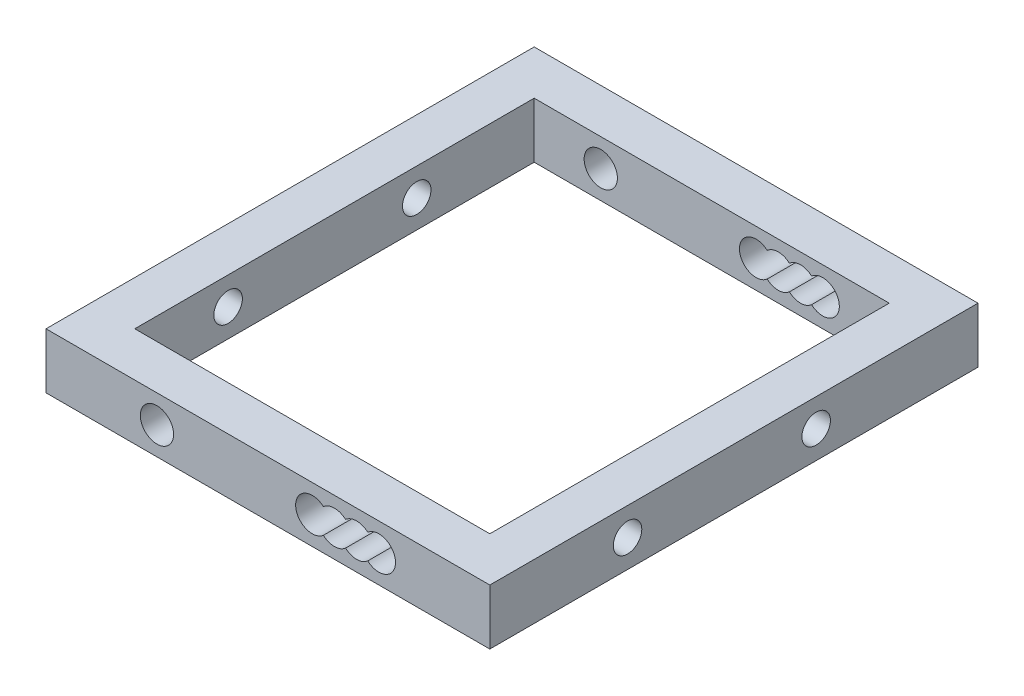
ISO-10303-21;
HEADER;
FILE_DESCRIPTION(('STEP AP214'),'2;1');
FILE_NAME('part.step','',(''),(''),'','','');
FILE_SCHEMA(('AUTOMOTIVE_DESIGN { 1 0 10303 214 1 1 1 1 }'));
ENDSEC;
DATA;
#1=APPLICATION_CONTEXT('core data for automotive mechanical design processes');
#2=APPLICATION_PROTOCOL_DEFINITION('international standard','automotive_design',2000,#1);
#3=PRODUCT_CONTEXT('',#1,'mechanical');
#4=PRODUCT('Part','Part','',(#3));
#5=PRODUCT_RELATED_PRODUCT_CATEGORY('part','',(#4));
#6=PRODUCT_DEFINITION_FORMATION('','',#4);
#7=PRODUCT_DEFINITION_CONTEXT('part definition',#1,'design');
#8=PRODUCT_DEFINITION('design','',#6,#7);
#9=PRODUCT_DEFINITION_SHAPE('','',#8);
#10=(LENGTH_UNIT() NAMED_UNIT(*) SI_UNIT(.MILLI.,.METRE.));
#11=(NAMED_UNIT(*) PLANE_ANGLE_UNIT() SI_UNIT($,.RADIAN.));
#12=(NAMED_UNIT(*) SI_UNIT($,.STERADIAN.) SOLID_ANGLE_UNIT());
#13=UNCERTAINTY_MEASURE_WITH_UNIT(LENGTH_MEASURE(1.E-05),#10,'distance_accuracy_value','');
#14=(GEOMETRIC_REPRESENTATION_CONTEXT(3) GLOBAL_UNCERTAINTY_ASSIGNED_CONTEXT((#13)) GLOBAL_UNIT_ASSIGNED_CONTEXT((#10,
#11,#12)) REPRESENTATION_CONTEXT('',''));
#15=CARTESIAN_POINT('',(0.,0.,0.));
#16=DIRECTION('',(0.,0.,1.));
#17=DIRECTION('',(1.,0.,0.));
#18=AXIS2_PLACEMENT_3D('',#15,#16,#17);
#19=CARTESIAN_POINT('',(16.,-2.5,-40.));
#20=DIRECTION('',(-1.,0.,0.));
#21=DIRECTION('',(0.,0.,1.));
#22=AXIS2_PLACEMENT_3D('',#19,#20,#21);
#23=PLANE('',#22);
#24=CARTESIAN_POINT('',(16.,0.,-25.4129080623112));
#25=DIRECTION('',(-1.,0.,0.));
#26=DIRECTION('',(0.,0.,1.));
#27=AXIS2_PLACEMENT_3D('',#24,#25,#26);
#28=CIRCLE('',#27,1.28530424586943);
#29=CARTESIAN_POINT('',(16.,0.,-24.1276038164417));
#30=VERTEX_POINT('',#29);
#31=EDGE_CURVE('E289',#30,#30,#28,.T.);
#32=ORIENTED_EDGE('',*,*,#31,.F.);
#33=EDGE_LOOP('',(#32));
#34=FACE_BOUND('',#33,.T.);
#35=CARTESIAN_POINT('',(16.,0.,-8.41290806231116));
#36=DIRECTION('',(-1.,0.,0.));
#37=DIRECTION('',(0.,0.,1.));
#38=AXIS2_PLACEMENT_3D('',#35,#36,#37);
#39=CIRCLE('',#38,1.28530424586943);
#40=CARTESIAN_POINT('',(16.,0.,-7.12760381644173));
#41=VERTEX_POINT('',#40);
#42=EDGE_CURVE('E277',#41,#41,#39,.T.);
#43=ORIENTED_EDGE('',*,*,#42,.F.);
#44=EDGE_LOOP('',(#43));
#45=FACE_BOUND('',#44,.T.);
#46=DIRECTION('',(0.,0.,1.));
#47=VECTOR('',#46,1.);
#48=CARTESIAN_POINT('',(16.,2.5,-40.));
#49=LINE('',#48,#47);
#50=CARTESIAN_POINT('',(16.,2.5,-36.));
#51=VERTEX_POINT('',#50);
#52=CARTESIAN_POINT('',(16.,2.5,0.));
#53=VERTEX_POINT('',#52);
#54=EDGE_CURVE('E49',#51,#53,#49,.T.);
#55=ORIENTED_EDGE('',*,*,#54,.F.);
#56=DIRECTION('',(0.,1.,0.));
#57=VECTOR('',#56,1.);
#58=CARTESIAN_POINT('',(16.,-2.5,-36.));
#59=LINE('',#58,#57);
#60=CARTESIAN_POINT('',(16.,-2.5,-36.));
#61=VERTEX_POINT('',#60);
#62=EDGE_CURVE('E54',#61,#51,#59,.T.);
#63=ORIENTED_EDGE('',*,*,#62,.F.);
#64=DIRECTION('',(0.,0.,1.));
#65=VECTOR('',#64,1.);
#66=CARTESIAN_POINT('',(16.,-2.5,-40.));
#67=LINE('',#66,#65);
#68=CARTESIAN_POINT('',(16.,-2.5,0.));
#69=VERTEX_POINT('',#68);
#70=EDGE_CURVE('E178',#61,#69,#67,.T.);
#71=ORIENTED_EDGE('',*,*,#70,.T.);
#72=DIRECTION('',(0.,1.,0.));
#73=VECTOR('',#72,1.);
#74=CARTESIAN_POINT('',(16.,-2.5,0.));
#75=LINE('',#74,#73);
#76=EDGE_CURVE('E317',#69,#53,#75,.T.);
#77=ORIENTED_EDGE('',*,*,#76,.T.);
#78=EDGE_LOOP('',(#55,#63,#71,#77));
#79=FACE_BOUND('',#78,.T.);
#80=ADVANCED_FACE('F32',(#34,#45,#79),#23,.T.);
#81=CARTESIAN_POINT('',(0.,0.,4.));
#82=DIRECTION('',(0.,0.,-1.));
#83=DIRECTION('',(-1.,0.,0.));
#84=AXIS2_PLACEMENT_3D('',#81,#82,#83);
#85=PLANE('',#84);
#86=CARTESIAN_POINT('',(-10.,0.,4.));
#87=DIRECTION('',(0.,0.,1.));
#88=DIRECTION('',(1.,0.,0.));
#89=AXIS2_PLACEMENT_3D('',#86,#87,#88);
#90=CIRCLE('',#89,1.5);
#91=CARTESIAN_POINT('',(-8.49999999999999,0.,4.));
#92=VERTEX_POINT('',#91);
#93=EDGE_CURVE('E326',#92,#92,#90,.T.);
#94=ORIENTED_EDGE('',*,*,#93,.F.);
#95=EDGE_LOOP('',(#94));
#96=FACE_BOUND('',#95,.T.);
#97=DIRECTION('',(1.,0.,0.));
#98=VECTOR('',#97,1.);
#99=CARTESIAN_POINT('',(-16.,-2.5,4.));
#100=LINE('',#99,#98);
#101=CARTESIAN_POINT('',(-20.,-2.5,4.));
#102=VERTEX_POINT('',#101);
#103=CARTESIAN_POINT('',(20.,-2.5,4.));
#104=VERTEX_POINT('',#103);
#105=EDGE_CURVE('E11',#102,#104,#100,.T.);
#106=ORIENTED_EDGE('',*,*,#105,.T.);
#107=DIRECTION('',(0.,1.,0.));
#108=VECTOR('',#107,1.);
#109=CARTESIAN_POINT('',(20.,-2.5,4.));
#110=LINE('',#109,#108);
#111=CARTESIAN_POINT('',(20.,2.5,4.));
#112=VERTEX_POINT('',#111);
#113=EDGE_CURVE('E262',#104,#112,#110,.T.);
#114=ORIENTED_EDGE('',*,*,#113,.T.);
#115=DIRECTION('',(-1.,0.,0.));
#116=VECTOR('',#115,1.);
#117=CARTESIAN_POINT('',(-16.,2.5,4.));
#118=LINE('',#117,#116);
#119=CARTESIAN_POINT('',(-20.,2.5,4.));
#120=VERTEX_POINT('',#119);
#121=EDGE_CURVE('E41',#112,#120,#118,.T.);
#122=ORIENTED_EDGE('',*,*,#121,.T.);
#123=DIRECTION('',(0.,1.,0.));
#124=VECTOR('',#123,1.);
#125=CARTESIAN_POINT('',(-20.,-2.5,4.));
#126=LINE('',#125,#124);
#127=EDGE_CURVE('E191',#102,#120,#126,.T.);
#128=ORIENTED_EDGE('',*,*,#127,.F.);
#129=EDGE_LOOP('',(#106,#114,#122,#128));
#130=FACE_BOUND('',#129,.T.);
#131=CARTESIAN_POINT('',(6.,0.,4.));
#132=DIRECTION('',(0.,0.,1.));
#133=DIRECTION('',(1.,0.,0.));
#134=AXIS2_PLACEMENT_3D('',#131,#132,#133);
#135=CIRCLE('',#134,1.5);
#136=CARTESIAN_POINT('',(5.,-1.1180339887499,4.));
#137=VERTEX_POINT('',#136);
#138=CARTESIAN_POINT('',(7.,-1.1180339887499,4.));
#139=VERTEX_POINT('',#138);
#140=EDGE_CURVE('E352',#137,#139,#135,.T.);
#141=ORIENTED_EDGE('',*,*,#140,.F.);
#142=CARTESIAN_POINT('',(4.,0.,4.));
#143=DIRECTION('',(0.,0.,1.));
#144=DIRECTION('',(1.,0.,0.));
#145=AXIS2_PLACEMENT_3D('',#142,#143,#144);
#146=CIRCLE('',#145,1.5);
#147=CARTESIAN_POINT('',(5.,1.11803398874989,4.));
#148=VERTEX_POINT('',#147);
#149=EDGE_CURVE('E348',#148,#137,#146,.T.);
#150=ORIENTED_EDGE('',*,*,#149,.F.);
#151=CARTESIAN_POINT('',(6.,0.,4.));
#152=DIRECTION('',(0.,0.,1.));
#153=DIRECTION('',(1.,0.,0.));
#154=AXIS2_PLACEMENT_3D('',#151,#152,#153);
#155=CIRCLE('',#154,1.5);
#156=CARTESIAN_POINT('',(7.,1.11803398874989,4.));
#157=VERTEX_POINT('',#156);
#158=EDGE_CURVE('E368',#157,#148,#155,.T.);
#159=ORIENTED_EDGE('',*,*,#158,.F.);
#160=CARTESIAN_POINT('',(8.,0.,4.));
#161=DIRECTION('',(0.,0.,1.));
#162=DIRECTION('',(1.,0.,0.));
#163=AXIS2_PLACEMENT_3D('',#160,#161,#162);
#164=CIRCLE('',#163,1.5);
#165=CARTESIAN_POINT('',(9.,1.11803398874989,4.));
#166=VERTEX_POINT('',#165);
#167=EDGE_CURVE('E371',#166,#157,#164,.T.);
#168=ORIENTED_EDGE('',*,*,#167,.F.);
#169=CARTESIAN_POINT('',(10.,0.,4.));
#170=DIRECTION('',(0.,0.,1.));
#171=DIRECTION('',(1.,0.,0.));
#172=AXIS2_PLACEMENT_3D('',#169,#170,#171);
#173=CIRCLE('',#172,1.5);
#174=CARTESIAN_POINT('',(9.,-1.1180339887499,4.));
#175=VERTEX_POINT('',#174);
#176=EDGE_CURVE('E373',#175,#166,#173,.T.);
#177=ORIENTED_EDGE('',*,*,#176,.F.);
#178=CARTESIAN_POINT('',(8.,0.,4.));
#179=DIRECTION('',(0.,0.,1.));
#180=DIRECTION('',(1.,0.,0.));
#181=AXIS2_PLACEMENT_3D('',#178,#179,#180);
#182=CIRCLE('',#181,1.5);
#183=EDGE_CURVE('E375',#139,#175,#182,.T.);
#184=ORIENTED_EDGE('',*,*,#183,.F.);
#185=EDGE_LOOP('',(#141,#150,#159,#168,#177,#184));
#186=FACE_BOUND('',#185,.T.);
#187=ADVANCED_FACE('F391',(#96,#130,#186),#85,.F.);
#188=CARTESIAN_POINT('',(0.,0.,0.));
#189=DIRECTION('',(0.,0.,-1.));
#190=DIRECTION('',(-1.,0.,0.));
#191=AXIS2_PLACEMENT_3D('',#188,#189,#190);
#192=PLANE('',#191);
#193=CARTESIAN_POINT('',(-10.,0.,0.));
#194=DIRECTION('',(0.,0.,1.));
#195=DIRECTION('',(1.,0.,0.));
#196=AXIS2_PLACEMENT_3D('',#193,#194,#195);
#197=CIRCLE('',#196,1.5);
#198=CARTESIAN_POINT('',(-8.49999999999999,0.,0.));
#199=VERTEX_POINT('',#198);
#200=EDGE_CURVE('E329',#199,#199,#197,.T.);
#201=ORIENTED_EDGE('',*,*,#200,.T.);
#202=EDGE_LOOP('',(#201));
#203=FACE_BOUND('',#202,.T.);
#204=ORIENTED_EDGE('',*,*,#76,.F.);
#205=DIRECTION('',(1.,0.,0.));
#206=VECTOR('',#205,1.);
#207=CARTESIAN_POINT('',(-16.,-2.5,0.));
#208=LINE('',#207,#206);
#209=CARTESIAN_POINT('',(-16.,-2.5,0.));
#210=VERTEX_POINT('',#209);
#211=EDGE_CURVE('E302',#210,#69,#208,.T.);
#212=ORIENTED_EDGE('',*,*,#211,.F.);
#213=DIRECTION('',(0.,-1.,0.));
#214=VECTOR('',#213,1.);
#215=CARTESIAN_POINT('',(-16.,-2.5,0.));
#216=LINE('',#215,#214);
#217=CARTESIAN_POINT('',(-16.,2.5,0.));
#218=VERTEX_POINT('',#217);
#219=EDGE_CURVE('E307',#218,#210,#216,.T.);
#220=ORIENTED_EDGE('',*,*,#219,.F.);
#221=DIRECTION('',(-1.,0.,0.));
#222=VECTOR('',#221,1.);
#223=CARTESIAN_POINT('',(-16.,2.5,0.));
#224=LINE('',#223,#222);
#225=EDGE_CURVE('E313',#53,#218,#224,.T.);
#226=ORIENTED_EDGE('',*,*,#225,.F.);
#227=EDGE_LOOP('',(#204,#212,#220,#226));
#228=FACE_BOUND('',#227,.T.);
#229=CARTESIAN_POINT('',(4.,0.,0.));
#230=DIRECTION('',(0.,0.,1.));
#231=DIRECTION('',(1.,0.,0.));
#232=AXIS2_PLACEMENT_3D('',#229,#230,#231);
#233=CIRCLE('',#232,1.5);
#234=CARTESIAN_POINT('',(5.,1.11803398874989,0.));
#235=VERTEX_POINT('',#234);
#236=CARTESIAN_POINT('',(5.,-1.1180339887499,0.));
#237=VERTEX_POINT('',#236);
#238=EDGE_CURVE('E349',#235,#237,#233,.T.);
#239=ORIENTED_EDGE('',*,*,#238,.T.);
#240=CARTESIAN_POINT('',(6.,0.,0.));
#241=DIRECTION('',(0.,0.,1.));
#242=DIRECTION('',(1.,0.,0.));
#243=AXIS2_PLACEMENT_3D('',#240,#241,#242);
#244=CIRCLE('',#243,1.5);
#245=CARTESIAN_POINT('',(7.,-1.1180339887499,0.));
#246=VERTEX_POINT('',#245);
#247=EDGE_CURVE('E272',#237,#246,#244,.T.);
#248=ORIENTED_EDGE('',*,*,#247,.T.);
#249=CARTESIAN_POINT('',(8.,0.,0.));
#250=DIRECTION('',(0.,0.,1.));
#251=DIRECTION('',(1.,0.,0.));
#252=AXIS2_PLACEMENT_3D('',#249,#250,#251);
#253=CIRCLE('',#252,1.5);
#254=CARTESIAN_POINT('',(9.,-1.1180339887499,0.));
#255=VERTEX_POINT('',#254);
#256=EDGE_CURVE('E362',#246,#255,#253,.T.);
#257=ORIENTED_EDGE('',*,*,#256,.T.);
#258=CARTESIAN_POINT('',(10.,0.,0.));
#259=DIRECTION('',(0.,0.,1.));
#260=DIRECTION('',(1.,0.,0.));
#261=AXIS2_PLACEMENT_3D('',#258,#259,#260);
#262=CIRCLE('',#261,1.5);
#263=CARTESIAN_POINT('',(9.,1.11803398874989,0.));
#264=VERTEX_POINT('',#263);
#265=EDGE_CURVE('E359',#255,#264,#262,.T.);
#266=ORIENTED_EDGE('',*,*,#265,.T.);
#267=CARTESIAN_POINT('',(8.,0.,0.));
#268=DIRECTION('',(0.,0.,1.));
#269=DIRECTION('',(1.,0.,0.));
#270=AXIS2_PLACEMENT_3D('',#267,#268,#269);
#271=CIRCLE('',#270,1.5);
#272=CARTESIAN_POINT('',(7.,1.11803398874989,0.));
#273=VERTEX_POINT('',#272);
#274=EDGE_CURVE('E356',#264,#273,#271,.T.);
#275=ORIENTED_EDGE('',*,*,#274,.T.);
#276=CARTESIAN_POINT('',(6.,0.,0.));
#277=DIRECTION('',(0.,0.,1.));
#278=DIRECTION('',(1.,0.,0.));
#279=AXIS2_PLACEMENT_3D('',#276,#277,#278);
#280=CIRCLE('',#279,1.5);
#281=EDGE_CURVE('E353',#273,#235,#280,.T.);
#282=ORIENTED_EDGE('',*,*,#281,.T.);
#283=EDGE_LOOP('',(#239,#248,#257,#266,#275,#282));
#284=FACE_BOUND('',#283,.T.);
#285=ADVANCED_FACE('F315',(#203,#228,#284),#192,.T.);
#286=CARTESIAN_POINT('',(-16.,2.5,4.));
#287=DIRECTION('',(0.,-1.,0.));
#288=DIRECTION('',(0.,0.,-1.));
#289=AXIS2_PLACEMENT_3D('',#286,#287,#288);
#290=PLANE('',#289);
#291=ORIENTED_EDGE('',*,*,#225,.T.);
#292=DIRECTION('',(0.,0.,1.));
#293=VECTOR('',#292,1.);
#294=CARTESIAN_POINT('',(-16.,2.5,-40.));
#295=LINE('',#294,#293);
#296=CARTESIAN_POINT('',(-16.,2.5,-36.));
#297=VERTEX_POINT('',#296);
#298=EDGE_CURVE('E190',#297,#218,#295,.T.);
#299=ORIENTED_EDGE('',*,*,#298,.F.);
#300=DIRECTION('',(-1.,0.,0.));
#301=VECTOR('',#300,1.);
#302=CARTESIAN_POINT('',(-16.,2.5,-36.));
#303=LINE('',#302,#301);
#304=EDGE_CURVE('E255',#51,#297,#303,.T.);
#305=ORIENTED_EDGE('',*,*,#304,.F.);
#306=ORIENTED_EDGE('',*,*,#54,.T.);
#307=EDGE_LOOP('',(#291,#299,#305,#306));
#308=FACE_BOUND('',#307,.T.);
#309=DIRECTION('',(0.,0.,1.));
#310=VECTOR('',#309,1.);
#311=CARTESIAN_POINT('',(-20.,2.5,-40.));
#312=LINE('',#311,#310);
#313=CARTESIAN_POINT('',(-20.,2.5,-40.));
#314=VERTEX_POINT('',#313);
#315=EDGE_CURVE('E172',#314,#120,#312,.T.);
#316=ORIENTED_EDGE('',*,*,#315,.T.);
#317=ORIENTED_EDGE('',*,*,#121,.F.);
#318=DIRECTION('',(0.,0.,1.));
#319=VECTOR('',#318,1.);
#320=CARTESIAN_POINT('',(20.,2.5,-40.));
#321=LINE('',#320,#319);
#322=CARTESIAN_POINT('',(20.,2.5,-40.));
#323=VERTEX_POINT('',#322);
#324=EDGE_CURVE('E174',#323,#112,#321,.T.);
#325=ORIENTED_EDGE('',*,*,#324,.F.);
#326=DIRECTION('',(-1.,0.,0.));
#327=VECTOR('',#326,1.);
#328=CARTESIAN_POINT('',(16.,2.5,-40.));
#329=LINE('',#328,#327);
#330=EDGE_CURVE('E169',#323,#314,#329,.T.);
#331=ORIENTED_EDGE('',*,*,#330,.T.);
#332=EDGE_LOOP('',(#316,#317,#325,#331));
#333=FACE_BOUND('',#332,.T.);
#334=ADVANCED_FACE('F34',(#308,#333),#290,.F.);
#335=CARTESIAN_POINT('',(-16.,-2.5,4.));
#336=DIRECTION('',(0.,1.,0.));
#337=DIRECTION('',(0.,0.,1.));
#338=AXIS2_PLACEMENT_3D('',#335,#336,#337);
#339=PLANE('',#338);
#340=DIRECTION('',(0.,0.,1.));
#341=VECTOR('',#340,1.);
#342=CARTESIAN_POINT('',(-16.,-2.5,-40.));
#343=LINE('',#342,#341);
#344=CARTESIAN_POINT('',(-16.,-2.5,-36.));
#345=VERTEX_POINT('',#344);
#346=EDGE_CURVE('E198',#345,#210,#343,.T.);
#347=ORIENTED_EDGE('',*,*,#346,.T.);
#348=ORIENTED_EDGE('',*,*,#211,.T.);
#349=ORIENTED_EDGE('',*,*,#70,.F.);
#350=DIRECTION('',(1.,0.,0.));
#351=VECTOR('',#350,1.);
#352=CARTESIAN_POINT('',(-16.,-2.5,-36.));
#353=LINE('',#352,#351);
#354=EDGE_CURVE('E259',#345,#61,#353,.T.);
#355=ORIENTED_EDGE('',*,*,#354,.F.);
#356=EDGE_LOOP('',(#347,#348,#349,#355));
#357=FACE_BOUND('',#356,.T.);
#358=ORIENTED_EDGE('',*,*,#105,.F.);
#359=DIRECTION('',(0.,0.,1.));
#360=VECTOR('',#359,1.);
#361=CARTESIAN_POINT('',(-20.,-2.5,-40.));
#362=LINE('',#361,#360);
#363=CARTESIAN_POINT('',(-20.,-2.5,-40.));
#364=VERTEX_POINT('',#363);
#365=EDGE_CURVE('E196',#364,#102,#362,.T.);
#366=ORIENTED_EDGE('',*,*,#365,.F.);
#367=DIRECTION('',(1.,0.,0.));
#368=VECTOR('',#367,1.);
#369=CARTESIAN_POINT('',(16.,-2.5,-40.));
#370=LINE('',#369,#368);
#371=CARTESIAN_POINT('',(20.,-2.5,-40.));
#372=VERTEX_POINT('',#371);
#373=EDGE_CURVE('E186',#364,#372,#370,.T.);
#374=ORIENTED_EDGE('',*,*,#373,.T.);
#375=DIRECTION('',(0.,0.,1.));
#376=VECTOR('',#375,1.);
#377=CARTESIAN_POINT('',(20.,-2.5,-40.));
#378=LINE('',#377,#376);
#379=EDGE_CURVE('E378',#372,#104,#378,.T.);
#380=ORIENTED_EDGE('',*,*,#379,.T.);
#381=EDGE_LOOP('',(#358,#366,#374,#380));
#382=FACE_BOUND('',#381,.T.);
#383=ADVANCED_FACE('F299',(#357,#382),#339,.F.);
#384=CARTESIAN_POINT('',(-10.,0.,4.));
#385=DIRECTION('',(0.,0.,-1.));
#386=DIRECTION('',(-1.,0.,0.));
#387=AXIS2_PLACEMENT_3D('',#384,#385,#386);
#388=CYLINDRICAL_SURFACE('',#387,1.5);
#389=ORIENTED_EDGE('',*,*,#93,.T.);
#390=EDGE_LOOP('',(#389));
#391=FACE_BOUND('',#390,.T.);
#392=ORIENTED_EDGE('',*,*,#200,.F.);
#393=EDGE_LOOP('',(#392));
#394=FACE_BOUND('',#393,.T.);
#395=ADVANCED_FACE('F390',(#391,#394),#388,.F.);
#396=CARTESIAN_POINT('',(6.,0.,4.));
#397=DIRECTION('',(0.,0.,-1.));
#398=DIRECTION('',(-1.,0.,0.));
#399=AXIS2_PLACEMENT_3D('',#396,#397,#398);
#400=CYLINDRICAL_SURFACE('',#399,1.5);
#401=ORIENTED_EDGE('',*,*,#247,.F.);
#402=DIRECTION('',(0.,0.,-1.));
#403=VECTOR('',#402,1.);
#404=CARTESIAN_POINT('',(5.,-1.1180339887499,4.));
#405=LINE('',#404,#403);
#406=EDGE_CURVE('E345',#137,#237,#405,.T.);
#407=ORIENTED_EDGE('',*,*,#406,.F.);
#408=ORIENTED_EDGE('',*,*,#140,.T.);
#409=DIRECTION('',(0.,0.,-1.));
#410=VECTOR('',#409,1.);
#411=CARTESIAN_POINT('',(7.,-1.1180339887499,4.));
#412=LINE('',#411,#410);
#413=EDGE_CURVE('E332',#139,#246,#412,.T.);
#414=ORIENTED_EDGE('',*,*,#413,.T.);
#415=EDGE_LOOP('',(#401,#407,#408,#414));
#416=FACE_BOUND('',#415,.T.);
#417=ADVANCED_FACE('F427',(#416),#400,.F.);
#418=CARTESIAN_POINT('',(8.,0.,4.));
#419=DIRECTION('',(0.,0.,-1.));
#420=DIRECTION('',(-1.,0.,0.));
#421=AXIS2_PLACEMENT_3D('',#418,#419,#420);
#422=CYLINDRICAL_SURFACE('',#421,1.5);
#423=ORIENTED_EDGE('',*,*,#256,.F.);
#424=ORIENTED_EDGE('',*,*,#413,.F.);
#425=ORIENTED_EDGE('',*,*,#183,.T.);
#426=DIRECTION('',(0.,0.,-1.));
#427=VECTOR('',#426,1.);
#428=CARTESIAN_POINT('',(9.,-1.1180339887499,4.));
#429=LINE('',#428,#427);
#430=EDGE_CURVE('E337',#175,#255,#429,.T.);
#431=ORIENTED_EDGE('',*,*,#430,.T.);
#432=EDGE_LOOP('',(#423,#424,#425,#431));
#433=FACE_BOUND('',#432,.T.);
#434=ADVANCED_FACE('F423',(#433),#422,.F.);
#435=CARTESIAN_POINT('',(10.,0.,4.));
#436=DIRECTION('',(0.,0.,-1.));
#437=DIRECTION('',(-1.,0.,0.));
#438=AXIS2_PLACEMENT_3D('',#435,#436,#437);
#439=CYLINDRICAL_SURFACE('',#438,1.5);
#440=ORIENTED_EDGE('',*,*,#265,.F.);
#441=ORIENTED_EDGE('',*,*,#430,.F.);
#442=ORIENTED_EDGE('',*,*,#176,.T.);
#443=DIRECTION('',(0.,0.,-1.));
#444=VECTOR('',#443,1.);
#445=CARTESIAN_POINT('',(9.,1.11803398874989,4.));
#446=LINE('',#445,#444);
#447=EDGE_CURVE('E339',#166,#264,#446,.T.);
#448=ORIENTED_EDGE('',*,*,#447,.T.);
#449=EDGE_LOOP('',(#440,#441,#442,#448));
#450=FACE_BOUND('',#449,.T.);
#451=ADVANCED_FACE('F419',(#450),#439,.F.);
#452=CARTESIAN_POINT('',(8.,0.,4.));
#453=DIRECTION('',(0.,0.,-1.));
#454=DIRECTION('',(-1.,0.,0.));
#455=AXIS2_PLACEMENT_3D('',#452,#453,#454);
#456=CYLINDRICAL_SURFACE('',#455,1.5);
#457=ORIENTED_EDGE('',*,*,#274,.F.);
#458=ORIENTED_EDGE('',*,*,#447,.F.);
#459=ORIENTED_EDGE('',*,*,#167,.T.);
#460=DIRECTION('',(0.,0.,-1.));
#461=VECTOR('',#460,1.);
#462=CARTESIAN_POINT('',(7.,1.11803398874989,4.));
#463=LINE('',#462,#461);
#464=EDGE_CURVE('E341',#157,#273,#463,.T.);
#465=ORIENTED_EDGE('',*,*,#464,.T.);
#466=EDGE_LOOP('',(#457,#458,#459,#465));
#467=FACE_BOUND('',#466,.T.);
#468=ADVANCED_FACE('F415',(#467),#456,.F.);
#469=CARTESIAN_POINT('',(6.,0.,4.));
#470=DIRECTION('',(0.,0.,-1.));
#471=DIRECTION('',(-1.,0.,0.));
#472=AXIS2_PLACEMENT_3D('',#469,#470,#471);
#473=CYLINDRICAL_SURFACE('',#472,1.5);
#474=ORIENTED_EDGE('',*,*,#281,.F.);
#475=ORIENTED_EDGE('',*,*,#464,.F.);
#476=ORIENTED_EDGE('',*,*,#158,.T.);
#477=DIRECTION('',(0.,0.,-1.));
#478=VECTOR('',#477,1.);
#479=CARTESIAN_POINT('',(5.,1.11803398874989,4.));
#480=LINE('',#479,#478);
#481=EDGE_CURVE('E343',#148,#235,#480,.T.);
#482=ORIENTED_EDGE('',*,*,#481,.T.);
#483=EDGE_LOOP('',(#474,#475,#476,#482));
#484=FACE_BOUND('',#483,.T.);
#485=ADVANCED_FACE('F411',(#484),#473,.F.);
#486=CARTESIAN_POINT('',(4.,0.,4.));
#487=DIRECTION('',(0.,0.,-1.));
#488=DIRECTION('',(-1.,0.,0.));
#489=AXIS2_PLACEMENT_3D('',#486,#487,#488);
#490=CYLINDRICAL_SURFACE('',#489,1.5);
#491=ORIENTED_EDGE('',*,*,#238,.F.);
#492=ORIENTED_EDGE('',*,*,#481,.F.);
#493=ORIENTED_EDGE('',*,*,#149,.T.);
#494=ORIENTED_EDGE('',*,*,#406,.T.);
#495=EDGE_LOOP('',(#491,#492,#493,#494));
#496=FACE_BOUND('',#495,.T.);
#497=ADVANCED_FACE('F408',(#496),#490,.F.);
#498=CARTESIAN_POINT('',(20.,-2.5,-40.));
#499=DIRECTION('',(1.,0.,0.));
#500=DIRECTION('',(0.,0.,-1.));
#501=AXIS2_PLACEMENT_3D('',#498,#499,#500);
#502=PLANE('',#501);
#503=CARTESIAN_POINT('',(20.,0.,-25.4129080623112));
#504=DIRECTION('',(1.,0.,0.));
#505=DIRECTION('',(0.,0.,-1.));
#506=AXIS2_PLACEMENT_3D('',#503,#504,#505);
#507=CIRCLE('',#506,1.28530424586943);
#508=CARTESIAN_POINT('',(20.,0.,-26.6982123081806));
#509=VERTEX_POINT('',#508);
#510=EDGE_CURVE('E465',#509,#509,#507,.T.);
#511=ORIENTED_EDGE('',*,*,#510,.F.);
#512=EDGE_LOOP('',(#511));
#513=FACE_BOUND('',#512,.T.);
#514=CARTESIAN_POINT('',(20.,0.,-8.41290806231116));
#515=DIRECTION('',(1.,0.,0.));
#516=DIRECTION('',(0.,0.,-1.));
#517=AXIS2_PLACEMENT_3D('',#514,#515,#516);
#518=CIRCLE('',#517,1.28530424586943);
#519=CARTESIAN_POINT('',(20.,0.,-9.69821230818059));
#520=VERTEX_POINT('',#519);
#521=EDGE_CURVE('E284',#520,#520,#518,.T.);
#522=ORIENTED_EDGE('',*,*,#521,.F.);
#523=EDGE_LOOP('',(#522));
#524=FACE_BOUND('',#523,.T.);
#525=ORIENTED_EDGE('',*,*,#113,.F.);
#526=ORIENTED_EDGE('',*,*,#379,.F.);
#527=DIRECTION('',(0.,1.,0.));
#528=VECTOR('',#527,1.);
#529=CARTESIAN_POINT('',(20.,-2.5,-40.));
#530=LINE('',#529,#528);
#531=EDGE_CURVE('E179',#372,#323,#530,.T.);
#532=ORIENTED_EDGE('',*,*,#531,.T.);
#533=ORIENTED_EDGE('',*,*,#324,.T.);
#534=EDGE_LOOP('',(#525,#526,#532,#533));
#535=FACE_BOUND('',#534,.T.);
#536=ADVANCED_FACE('F406',(#513,#524,#535),#502,.T.);
#537=CARTESIAN_POINT('',(0.,0.,-40.));
#538=DIRECTION('',(0.,0.,-1.));
#539=DIRECTION('',(-1.,0.,0.));
#540=AXIS2_PLACEMENT_3D('',#537,#538,#539);
#541=PLANE('',#540);
#542=ORIENTED_EDGE('',*,*,#373,.F.);
#543=DIRECTION('',(0.,1.,0.));
#544=VECTOR('',#543,1.);
#545=CARTESIAN_POINT('',(-20.,-2.5,-40.));
#546=LINE('',#545,#544);
#547=EDGE_CURVE('E182',#364,#314,#546,.T.);
#548=ORIENTED_EDGE('',*,*,#547,.T.);
#549=ORIENTED_EDGE('',*,*,#330,.F.);
#550=ORIENTED_EDGE('',*,*,#531,.F.);
#551=EDGE_LOOP('',(#542,#548,#549,#550));
#552=FACE_BOUND('',#551,.T.);
#553=CARTESIAN_POINT('',(-10.,0.,-40.));
#554=DIRECTION('',(0.,0.,1.));
#555=DIRECTION('',(1.,0.,0.));
#556=AXIS2_PLACEMENT_3D('',#553,#554,#555);
#557=CIRCLE('',#556,1.5);
#558=CARTESIAN_POINT('',(-8.49999999999999,0.,-40.));
#559=VERTEX_POINT('',#558);
#560=EDGE_CURVE('E248',#559,#559,#557,.T.);
#561=ORIENTED_EDGE('',*,*,#560,.T.);
#562=EDGE_LOOP('',(#561));
#563=FACE_BOUND('',#562,.T.);
#564=CARTESIAN_POINT('',(4.,0.,-40.));
#565=DIRECTION('',(0.,0.,1.));
#566=DIRECTION('',(1.,0.,0.));
#567=AXIS2_PLACEMENT_3D('',#564,#565,#566);
#568=CIRCLE('',#567,1.5);
#569=CARTESIAN_POINT('',(5.,1.11803398874989,-40.));
#570=VERTEX_POINT('',#569);
#571=CARTESIAN_POINT('',(5.,-1.1180339887499,-40.));
#572=VERTEX_POINT('',#571);
#573=EDGE_CURVE('E206',#570,#572,#568,.T.);
#574=ORIENTED_EDGE('',*,*,#573,.T.);
#575=CARTESIAN_POINT('',(6.,0.,-40.));
#576=DIRECTION('',(0.,0.,1.));
#577=DIRECTION('',(1.,0.,0.));
#578=AXIS2_PLACEMENT_3D('',#575,#576,#577);
#579=CIRCLE('',#578,1.5);
#580=CARTESIAN_POINT('',(7.,-1.1180339887499,-40.));
#581=VERTEX_POINT('',#580);
#582=EDGE_CURVE('E218',#572,#581,#579,.T.);
#583=ORIENTED_EDGE('',*,*,#582,.T.);
#584=CARTESIAN_POINT('',(8.,0.,-40.));
#585=DIRECTION('',(0.,0.,1.));
#586=DIRECTION('',(1.,0.,0.));
#587=AXIS2_PLACEMENT_3D('',#584,#585,#586);
#588=CIRCLE('',#587,1.5);
#589=CARTESIAN_POINT('',(9.,-1.1180339887499,-40.));
#590=VERTEX_POINT('',#589);
#591=EDGE_CURVE('E221',#581,#590,#588,.T.);
#592=ORIENTED_EDGE('',*,*,#591,.T.);
#593=CARTESIAN_POINT('',(10.,0.,-40.));
#594=DIRECTION('',(0.,0.,1.));
#595=DIRECTION('',(1.,0.,0.));
#596=AXIS2_PLACEMENT_3D('',#593,#594,#595);
#597=CIRCLE('',#596,1.5);
#598=CARTESIAN_POINT('',(9.,1.11803398874989,-40.));
#599=VERTEX_POINT('',#598);
#600=EDGE_CURVE('E224',#590,#599,#597,.T.);
#601=ORIENTED_EDGE('',*,*,#600,.T.);
#602=CARTESIAN_POINT('',(8.,0.,-40.));
#603=DIRECTION('',(0.,0.,1.));
#604=DIRECTION('',(1.,0.,0.));
#605=AXIS2_PLACEMENT_3D('',#602,#603,#604);
#606=CIRCLE('',#605,1.5);
#607=CARTESIAN_POINT('',(7.,1.11803398874989,-40.));
#608=VERTEX_POINT('',#607);
#609=EDGE_CURVE('E227',#599,#608,#606,.T.);
#610=ORIENTED_EDGE('',*,*,#609,.T.);
#611=CARTESIAN_POINT('',(6.,0.,-40.));
#612=DIRECTION('',(0.,0.,1.));
#613=DIRECTION('',(1.,0.,0.));
#614=AXIS2_PLACEMENT_3D('',#611,#612,#613);
#615=CIRCLE('',#614,1.5);
#616=EDGE_CURVE('E230',#608,#570,#615,.T.);
#617=ORIENTED_EDGE('',*,*,#616,.T.);
#618=EDGE_LOOP('',(#574,#583,#592,#601,#610,#617));
#619=FACE_BOUND('',#618,.T.);
#620=ADVANCED_FACE('F183',(#552,#563,#619),#541,.T.);
#621=CARTESIAN_POINT('',(0.,0.,-36.));
#622=DIRECTION('',(0.,0.,-1.));
#623=DIRECTION('',(-1.,0.,0.));
#624=AXIS2_PLACEMENT_3D('',#621,#622,#623);
#625=PLANE('',#624);
#626=CARTESIAN_POINT('',(-10.,0.,-36.));
#627=DIRECTION('',(0.,0.,1.));
#628=DIRECTION('',(1.,0.,0.));
#629=AXIS2_PLACEMENT_3D('',#626,#627,#628);
#630=CIRCLE('',#629,1.5);
#631=CARTESIAN_POINT('',(-8.49999999999999,0.,-36.));
#632=VERTEX_POINT('',#631);
#633=EDGE_CURVE('E249',#632,#632,#630,.T.);
#634=ORIENTED_EDGE('',*,*,#633,.F.);
#635=EDGE_LOOP('',(#634));
#636=FACE_BOUND('',#635,.T.);
#637=ORIENTED_EDGE('',*,*,#62,.T.);
#638=ORIENTED_EDGE('',*,*,#304,.T.);
#639=DIRECTION('',(0.,-1.,0.));
#640=VECTOR('',#639,1.);
#641=CARTESIAN_POINT('',(-16.,-2.5,-36.));
#642=LINE('',#641,#640);
#643=EDGE_CURVE('E257',#297,#345,#642,.T.);
#644=ORIENTED_EDGE('',*,*,#643,.T.);
#645=ORIENTED_EDGE('',*,*,#354,.T.);
#646=EDGE_LOOP('',(#637,#638,#644,#645));
#647=FACE_BOUND('',#646,.T.);
#648=CARTESIAN_POINT('',(6.,0.,-36.));
#649=DIRECTION('',(0.,0.,1.));
#650=DIRECTION('',(1.,0.,0.));
#651=AXIS2_PLACEMENT_3D('',#648,#649,#650);
#652=CIRCLE('',#651,1.5);
#653=CARTESIAN_POINT('',(5.,-1.1180339887499,-36.));
#654=VERTEX_POINT('',#653);
#655=CARTESIAN_POINT('',(7.,-1.1180339887499,-36.));
#656=VERTEX_POINT('',#655);
#657=EDGE_CURVE('E203',#654,#656,#652,.T.);
#658=ORIENTED_EDGE('',*,*,#657,.F.);
#659=CARTESIAN_POINT('',(4.,0.,-36.));
#660=DIRECTION('',(0.,0.,1.));
#661=DIRECTION('',(1.,0.,0.));
#662=AXIS2_PLACEMENT_3D('',#659,#660,#661);
#663=CIRCLE('',#662,1.5);
#664=CARTESIAN_POINT('',(5.,1.11803398874989,-36.));
#665=VERTEX_POINT('',#664);
#666=EDGE_CURVE('E215',#665,#654,#663,.T.);
#667=ORIENTED_EDGE('',*,*,#666,.F.);
#668=CARTESIAN_POINT('',(6.,0.,-36.));
#669=DIRECTION('',(0.,0.,1.));
#670=DIRECTION('',(1.,0.,0.));
#671=AXIS2_PLACEMENT_3D('',#668,#669,#670);
#672=CIRCLE('',#671,1.5);
#673=CARTESIAN_POINT('',(7.,1.11803398874989,-36.));
#674=VERTEX_POINT('',#673);
#675=EDGE_CURVE('E212',#674,#665,#672,.T.);
#676=ORIENTED_EDGE('',*,*,#675,.F.);
#677=CARTESIAN_POINT('',(8.,0.,-36.));
#678=DIRECTION('',(0.,0.,1.));
#679=DIRECTION('',(1.,0.,0.));
#680=AXIS2_PLACEMENT_3D('',#677,#678,#679);
#681=CIRCLE('',#680,1.5);
#682=CARTESIAN_POINT('',(9.,1.11803398874989,-36.));
#683=VERTEX_POINT('',#682);
#684=EDGE_CURVE('E210',#683,#674,#681,.T.);
#685=ORIENTED_EDGE('',*,*,#684,.F.);
#686=CARTESIAN_POINT('',(10.,0.,-36.));
#687=DIRECTION('',(0.,0.,1.));
#688=DIRECTION('',(1.,0.,0.));
#689=AXIS2_PLACEMENT_3D('',#686,#687,#688);
#690=CIRCLE('',#689,1.5);
#691=CARTESIAN_POINT('',(9.,-1.1180339887499,-36.));
#692=VERTEX_POINT('',#691);
#693=EDGE_CURVE('E208',#692,#683,#690,.T.);
#694=ORIENTED_EDGE('',*,*,#693,.F.);
#695=CARTESIAN_POINT('',(8.,0.,-36.));
#696=DIRECTION('',(0.,0.,1.));
#697=DIRECTION('',(1.,0.,0.));
#698=AXIS2_PLACEMENT_3D('',#695,#696,#697);
#699=CIRCLE('',#698,1.5);
#700=EDGE_CURVE('E205',#656,#692,#699,.T.);
#701=ORIENTED_EDGE('',*,*,#700,.F.);
#702=EDGE_LOOP('',(#658,#667,#676,#685,#694,#701));
#703=FACE_BOUND('',#702,.T.);
#704=ADVANCED_FACE('F382',(#636,#647,#703),#625,.F.);
#705=CARTESIAN_POINT('',(-10.,0.,-36.));
#706=DIRECTION('',(0.,0.,-1.));
#707=DIRECTION('',(-1.,0.,0.));
#708=AXIS2_PLACEMENT_3D('',#705,#706,#707);
#709=CYLINDRICAL_SURFACE('',#708,1.5);
#710=ORIENTED_EDGE('',*,*,#633,.T.);
#711=EDGE_LOOP('',(#710));
#712=FACE_BOUND('',#711,.T.);
#713=ORIENTED_EDGE('',*,*,#560,.F.);
#714=EDGE_LOOP('',(#713));
#715=FACE_BOUND('',#714,.T.);
#716=ADVANCED_FACE('F514',(#712,#715),#709,.F.);
#717=CARTESIAN_POINT('',(6.,0.,-36.));
#718=DIRECTION('',(0.,0.,-1.));
#719=DIRECTION('',(-1.,0.,0.));
#720=AXIS2_PLACEMENT_3D('',#717,#718,#719);
#721=CYLINDRICAL_SURFACE('',#720,1.5);
#722=ORIENTED_EDGE('',*,*,#582,.F.);
#723=DIRECTION('',(0.,0.,-1.));
#724=VECTOR('',#723,1.);
#725=CARTESIAN_POINT('',(5.,-1.1180339887499,-36.));
#726=LINE('',#725,#724);
#727=EDGE_CURVE('E217',#654,#572,#726,.T.);
#728=ORIENTED_EDGE('',*,*,#727,.F.);
#729=ORIENTED_EDGE('',*,*,#657,.T.);
#730=DIRECTION('',(0.,0.,-1.));
#731=VECTOR('',#730,1.);
#732=CARTESIAN_POINT('',(7.,-1.1180339887499,-36.));
#733=LINE('',#732,#731);
#734=EDGE_CURVE('E245',#656,#581,#733,.T.);
#735=ORIENTED_EDGE('',*,*,#734,.T.);
#736=EDGE_LOOP('',(#722,#728,#729,#735));
#737=FACE_BOUND('',#736,.T.);
#738=ADVANCED_FACE('F510',(#737),#721,.F.);
#739=CARTESIAN_POINT('',(8.,0.,-36.));
#740=DIRECTION('',(0.,0.,-1.));
#741=DIRECTION('',(-1.,0.,0.));
#742=AXIS2_PLACEMENT_3D('',#739,#740,#741);
#743=CYLINDRICAL_SURFACE('',#742,1.5);
#744=ORIENTED_EDGE('',*,*,#591,.F.);
#745=ORIENTED_EDGE('',*,*,#734,.F.);
#746=ORIENTED_EDGE('',*,*,#700,.T.);
#747=DIRECTION('',(0.,0.,-1.));
#748=VECTOR('',#747,1.);
#749=CARTESIAN_POINT('',(9.,-1.1180339887499,-36.));
#750=LINE('',#749,#748);
#751=EDGE_CURVE('E243',#692,#590,#750,.T.);
#752=ORIENTED_EDGE('',*,*,#751,.T.);
#753=EDGE_LOOP('',(#744,#745,#746,#752));
#754=FACE_BOUND('',#753,.T.);
#755=ADVANCED_FACE('F506',(#754),#743,.F.);
#756=CARTESIAN_POINT('',(10.,0.,-36.));
#757=DIRECTION('',(0.,0.,-1.));
#758=DIRECTION('',(-1.,0.,0.));
#759=AXIS2_PLACEMENT_3D('',#756,#757,#758);
#760=CYLINDRICAL_SURFACE('',#759,1.5);
#761=ORIENTED_EDGE('',*,*,#600,.F.);
#762=ORIENTED_EDGE('',*,*,#751,.F.);
#763=ORIENTED_EDGE('',*,*,#693,.T.);
#764=DIRECTION('',(0.,0.,-1.));
#765=VECTOR('',#764,1.);
#766=CARTESIAN_POINT('',(9.,1.11803398874989,-36.));
#767=LINE('',#766,#765);
#768=EDGE_CURVE('E241',#683,#599,#767,.T.);
#769=ORIENTED_EDGE('',*,*,#768,.T.);
#770=EDGE_LOOP('',(#761,#762,#763,#769));
#771=FACE_BOUND('',#770,.T.);
#772=ADVANCED_FACE('F502',(#771),#760,.F.);
#773=CARTESIAN_POINT('',(8.,0.,-36.));
#774=DIRECTION('',(0.,0.,-1.));
#775=DIRECTION('',(-1.,0.,0.));
#776=AXIS2_PLACEMENT_3D('',#773,#774,#775);
#777=CYLINDRICAL_SURFACE('',#776,1.5);
#778=ORIENTED_EDGE('',*,*,#609,.F.);
#779=ORIENTED_EDGE('',*,*,#768,.F.);
#780=ORIENTED_EDGE('',*,*,#684,.T.);
#781=DIRECTION('',(0.,0.,-1.));
#782=VECTOR('',#781,1.);
#783=CARTESIAN_POINT('',(7.,1.11803398874989,-36.));
#784=LINE('',#783,#782);
#785=EDGE_CURVE('E239',#674,#608,#784,.T.);
#786=ORIENTED_EDGE('',*,*,#785,.T.);
#787=EDGE_LOOP('',(#778,#779,#780,#786));
#788=FACE_BOUND('',#787,.T.);
#789=ADVANCED_FACE('F498',(#788),#777,.F.);
#790=CARTESIAN_POINT('',(6.,0.,-36.));
#791=DIRECTION('',(0.,0.,-1.));
#792=DIRECTION('',(-1.,0.,0.));
#793=AXIS2_PLACEMENT_3D('',#790,#791,#792);
#794=CYLINDRICAL_SURFACE('',#793,1.5);
#795=ORIENTED_EDGE('',*,*,#616,.F.);
#796=ORIENTED_EDGE('',*,*,#785,.F.);
#797=ORIENTED_EDGE('',*,*,#675,.T.);
#798=DIRECTION('',(0.,0.,-1.));
#799=VECTOR('',#798,1.);
#800=CARTESIAN_POINT('',(5.,1.11803398874989,-36.));
#801=LINE('',#800,#799);
#802=EDGE_CURVE('E237',#665,#570,#801,.T.);
#803=ORIENTED_EDGE('',*,*,#802,.T.);
#804=EDGE_LOOP('',(#795,#796,#797,#803));
#805=FACE_BOUND('',#804,.T.);
#806=ADVANCED_FACE('F494',(#805),#794,.F.);
#807=CARTESIAN_POINT('',(4.,0.,-36.));
#808=DIRECTION('',(0.,0.,-1.));
#809=DIRECTION('',(-1.,0.,0.));
#810=AXIS2_PLACEMENT_3D('',#807,#808,#809);
#811=CYLINDRICAL_SURFACE('',#810,1.5);
#812=ORIENTED_EDGE('',*,*,#573,.F.);
#813=ORIENTED_EDGE('',*,*,#802,.F.);
#814=ORIENTED_EDGE('',*,*,#666,.T.);
#815=ORIENTED_EDGE('',*,*,#727,.T.);
#816=EDGE_LOOP('',(#812,#813,#814,#815));
#817=FACE_BOUND('',#816,.T.);
#818=ADVANCED_FACE('F490',(#817),#811,.F.);
#819=CARTESIAN_POINT('',(-16.,-2.5,-40.));
#820=DIRECTION('',(-1.,0.,0.));
#821=DIRECTION('',(0.,0.,1.));
#822=AXIS2_PLACEMENT_3D('',#819,#820,#821);
#823=PLANE('',#822);
#824=CARTESIAN_POINT('',(-16.,0.,-25.4129080623112));
#825=DIRECTION('',(-1.,0.,0.));
#826=DIRECTION('',(0.,0.,1.));
#827=AXIS2_PLACEMENT_3D('',#824,#825,#826);
#828=CIRCLE('',#827,1.28530424586943);
#829=CARTESIAN_POINT('',(-16.,0.,-24.1276038164417));
#830=VERTEX_POINT('',#829);
#831=EDGE_CURVE('E36',#830,#830,#828,.T.);
#832=ORIENTED_EDGE('',*,*,#831,.T.);
#833=EDGE_LOOP('',(#832));
#834=FACE_BOUND('',#833,.T.);
#835=CARTESIAN_POINT('',(-16.,0.,-8.41290806231116));
#836=DIRECTION('',(-1.,0.,0.));
#837=DIRECTION('',(0.,0.,1.));
#838=AXIS2_PLACEMENT_3D('',#835,#836,#837);
#839=CIRCLE('',#838,1.28530424586943);
#840=CARTESIAN_POINT('',(-16.,0.,-7.12760381644173));
#841=VERTEX_POINT('',#840);
#842=EDGE_CURVE('E275',#841,#841,#839,.T.);
#843=ORIENTED_EDGE('',*,*,#842,.T.);
#844=EDGE_LOOP('',(#843));
#845=FACE_BOUND('',#844,.T.);
#846=ORIENTED_EDGE('',*,*,#219,.T.);
#847=ORIENTED_EDGE('',*,*,#346,.F.);
#848=ORIENTED_EDGE('',*,*,#643,.F.);
#849=ORIENTED_EDGE('',*,*,#298,.T.);
#850=EDGE_LOOP('',(#846,#847,#848,#849));
#851=FACE_BOUND('',#850,.T.);
#852=ADVANCED_FACE('F308',(#834,#845,#851),#823,.F.);
#853=CARTESIAN_POINT('',(-20.,-2.5,-40.));
#854=DIRECTION('',(1.,0.,0.));
#855=DIRECTION('',(0.,0.,-1.));
#856=AXIS2_PLACEMENT_3D('',#853,#854,#855);
#857=PLANE('',#856);
#858=ORIENTED_EDGE('',*,*,#127,.T.);
#859=ORIENTED_EDGE('',*,*,#315,.F.);
#860=ORIENTED_EDGE('',*,*,#547,.F.);
#861=ORIENTED_EDGE('',*,*,#365,.T.);
#862=EDGE_LOOP('',(#858,#859,#860,#861));
#863=FACE_BOUND('',#862,.T.);
#864=ADVANCED_FACE('F194',(#863),#857,.F.);
#865=CARTESIAN_POINT('',(-19.,0.,-8.41290806231116));
#866=DIRECTION('',(1.,0.,0.));
#867=DIRECTION('',(0.,0.,-1.));
#868=AXIS2_PLACEMENT_3D('',#865,#866,#867);
#869=PLANE('',#868);
#870=CARTESIAN_POINT('',(-19.,0.,-8.41290806231116));
#871=DIRECTION('',(1.,0.,0.));
#872=DIRECTION('',(0.,0.,-1.));
#873=AXIS2_PLACEMENT_3D('',#870,#871,#872);
#874=CIRCLE('',#873,1.28530424586943);
#875=CARTESIAN_POINT('',(-19.,0.,-9.69821230818059));
#876=VERTEX_POINT('',#875);
#877=EDGE_CURVE('E278',#876,#876,#874,.T.);
#878=ORIENTED_EDGE('',*,*,#877,.T.);
#879=EDGE_LOOP('',(#878));
#880=FACE_BOUND('',#879,.T.);
#881=ADVANCED_FACE('F481',(#880),#869,.T.);
#882=CARTESIAN_POINT('',(-19.,0.,-8.41290806231116));
#883=DIRECTION('',(1.,0.,0.));
#884=DIRECTION('',(0.,0.,-1.));
#885=AXIS2_PLACEMENT_3D('',#882,#883,#884);
#886=CYLINDRICAL_SURFACE('',#885,1.28530424586943);
#887=ORIENTED_EDGE('',*,*,#877,.F.);
#888=EDGE_LOOP('',(#887));
#889=FACE_BOUND('',#888,.T.);
#890=ORIENTED_EDGE('',*,*,#842,.F.);
#891=EDGE_LOOP('',(#890));
#892=FACE_BOUND('',#891,.T.);
#893=ADVANCED_FACE('F471',(#889,#892),#886,.F.);
#894=ORIENTED_EDGE('',*,*,#42,.T.);
#895=EDGE_LOOP('',(#894));
#896=FACE_BOUND('',#895,.T.);
#897=ORIENTED_EDGE('',*,*,#521,.T.);
#898=EDGE_LOOP('',(#897));
#899=FACE_BOUND('',#898,.T.);
#900=ADVANCED_FACE('F468',(#896,#899),#886,.F.);
#901=CARTESIAN_POINT('',(-19.,0.,-25.4129080623112));
#902=DIRECTION('',(1.,0.,0.));
#903=DIRECTION('',(0.,0.,-1.));
#904=AXIS2_PLACEMENT_3D('',#901,#902,#903);
#905=PLANE('',#904);
#906=CARTESIAN_POINT('',(-19.,0.,-25.4129080623112));
#907=DIRECTION('',(1.,0.,0.));
#908=DIRECTION('',(0.,0.,-1.));
#909=AXIS2_PLACEMENT_3D('',#906,#907,#908);
#910=CIRCLE('',#909,1.28530424586943);
#911=CARTESIAN_POINT('',(-19.,0.,-26.6982123081806));
#912=VERTEX_POINT('',#911);
#913=EDGE_CURVE('E624',#912,#912,#910,.T.);
#914=ORIENTED_EDGE('',*,*,#913,.T.);
#915=EDGE_LOOP('',(#914));
#916=FACE_BOUND('',#915,.T.);
#917=ADVANCED_FACE('F470',(#916),#905,.T.);
#918=CARTESIAN_POINT('',(-19.,0.,-25.4129080623112));
#919=DIRECTION('',(1.,0.,0.));
#920=DIRECTION('',(0.,0.,-1.));
#921=AXIS2_PLACEMENT_3D('',#918,#919,#920);
#922=CYLINDRICAL_SURFACE('',#921,1.28530424586943);
#923=ORIENTED_EDGE('',*,*,#913,.F.);
#924=EDGE_LOOP('',(#923));
#925=FACE_BOUND('',#924,.T.);
#926=ORIENTED_EDGE('',*,*,#831,.F.);
#927=EDGE_LOOP('',(#926));
#928=FACE_BOUND('',#927,.T.);
#929=ADVANCED_FACE('F478',(#925,#928),#922,.F.);
#930=ORIENTED_EDGE('',*,*,#31,.T.);
#931=EDGE_LOOP('',(#930));
#932=FACE_BOUND('',#931,.T.);
#933=ORIENTED_EDGE('',*,*,#510,.T.);
#934=EDGE_LOOP('',(#933));
#935=FACE_BOUND('',#934,.T.);
#936=ADVANCED_FACE('F610',(#932,#935),#922,.F.);
#937=CLOSED_SHELL('',(#80,#187,#285,#334,#383,#395,#417,#434,#451,#468,#485,#497,#536,#620,#704,
#716,#738,#755,#772,#789,#806,#818,#852,#864,#881,#893,#900,#917,#929,#936));
#938=MANIFOLD_SOLID_BREP('B2',#937);
#939=ADVANCED_BREP_SHAPE_REPRESENTATION('',(#18,#938),#14);
#940=SHAPE_DEFINITION_REPRESENTATION(#9,#939);
ENDSEC;
END-ISO-10303-21;
